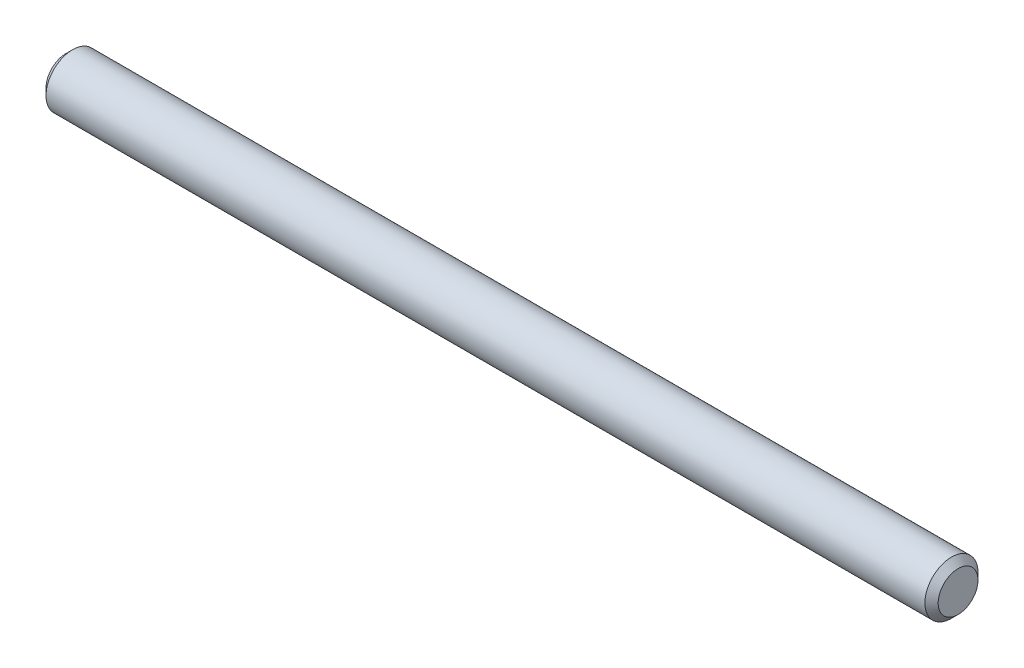
ISO-10303-21;
HEADER;
FILE_DESCRIPTION(('STEP AP214'),'2;1');
FILE_NAME('part.step','',(''),(''),'','','');
FILE_SCHEMA(('AUTOMOTIVE_DESIGN { 1 0 10303 214 1 1 1 1 }'));
ENDSEC;
DATA;
#1=APPLICATION_CONTEXT('core data for automotive mechanical design processes');
#2=APPLICATION_PROTOCOL_DEFINITION('international standard','automotive_design',2000,#1);
#3=PRODUCT_CONTEXT('',#1,'mechanical');
#4=PRODUCT('Part','Part','',(#3));
#5=PRODUCT_RELATED_PRODUCT_CATEGORY('part','',(#4));
#6=PRODUCT_DEFINITION_FORMATION('','',#4);
#7=PRODUCT_DEFINITION_CONTEXT('part definition',#1,'design');
#8=PRODUCT_DEFINITION('design','',#6,#7);
#9=PRODUCT_DEFINITION_SHAPE('','',#8);
#10=(LENGTH_UNIT() NAMED_UNIT(*) SI_UNIT(.MILLI.,.METRE.));
#11=(NAMED_UNIT(*) PLANE_ANGLE_UNIT() SI_UNIT($,.RADIAN.));
#12=(NAMED_UNIT(*) SI_UNIT($,.STERADIAN.) SOLID_ANGLE_UNIT());
#13=UNCERTAINTY_MEASURE_WITH_UNIT(LENGTH_MEASURE(1.E-05),#10,'distance_accuracy_value','');
#14=(GEOMETRIC_REPRESENTATION_CONTEXT(3) GLOBAL_UNCERTAINTY_ASSIGNED_CONTEXT((#13)) GLOBAL_UNIT_ASSIGNED_CONTEXT((#10,
#11,#12)) REPRESENTATION_CONTEXT('',''));
#15=CARTESIAN_POINT('',(0.,0.,0.));
#16=DIRECTION('',(0.,0.,1.));
#17=DIRECTION('',(1.,0.,0.));
#18=AXIS2_PLACEMENT_3D('',#15,#16,#17);
#19=CARTESIAN_POINT('',(-160.,0.,0.));
#20=DIRECTION('',(1.,0.,0.));
#21=DIRECTION('',(0.,0.,-1.));
#22=AXIS2_PLACEMENT_3D('',#19,#20,#21);
#23=CYLINDRICAL_SURFACE('',#22,4.76249999999998);
#24=CARTESIAN_POINT('',(-158.809375,0.,0.));
#25=DIRECTION('',(1.,0.,0.));
#26=DIRECTION('',(0.,0.,-1.));
#27=AXIS2_PLACEMENT_3D('',#24,#25,#26);
#28=CIRCLE('',#27,4.76249999999998);
#29=CARTESIAN_POINT('',(-158.809375,0.,-4.76249999999998));
#30=VERTEX_POINT('',#29);
#31=EDGE_CURVE('E52',#30,#30,#28,.T.);
#32=ORIENTED_EDGE('',*,*,#31,.T.);
#33=EDGE_LOOP('',(#32));
#34=FACE_BOUND('',#33,.T.);
#35=CARTESIAN_POINT('',(-1.190625,0.,0.));
#36=DIRECTION('',(1.,0.,0.));
#37=DIRECTION('',(0.,0.,-1.));
#38=AXIS2_PLACEMENT_3D('',#35,#36,#37);
#39=CIRCLE('',#38,4.76249999999998);
#40=CARTESIAN_POINT('',(-1.190625,0.,-4.76249999999998));
#41=VERTEX_POINT('',#40);
#42=EDGE_CURVE('E56',#41,#41,#39,.F.);
#43=ORIENTED_EDGE('',*,*,#42,.T.);
#44=EDGE_LOOP('',(#43));
#45=FACE_BOUND('',#44,.T.);
#46=ADVANCED_FACE('F41',(#34,#45),#23,.T.);
#47=CARTESIAN_POINT('',(-160.,0.,0.));
#48=DIRECTION('',(1.,0.,0.));
#49=DIRECTION('',(0.,0.,-1.));
#50=AXIS2_PLACEMENT_3D('',#47,#48,#49);
#51=PLANE('',#50);
#52=CARTESIAN_POINT('',(-160.,0.,0.));
#53=DIRECTION('',(1.,0.,0.));
#54=DIRECTION('',(0.,0.,-1.));
#55=AXIS2_PLACEMENT_3D('',#52,#53,#54);
#56=CIRCLE('',#55,3.57187499999996);
#57=CARTESIAN_POINT('',(-160.,0.,-3.57187499999996));
#58=VERTEX_POINT('',#57);
#59=EDGE_CURVE('E48',#58,#58,#56,.F.);
#60=ORIENTED_EDGE('',*,*,#59,.T.);
#61=EDGE_LOOP('',(#60));
#62=FACE_BOUND('',#61,.T.);
#63=ADVANCED_FACE('F72',(#62),#51,.F.);
#64=CARTESIAN_POINT('',(0.,0.,0.));
#65=DIRECTION('',(1.,0.,0.));
#66=DIRECTION('',(0.,0.,-1.));
#67=AXIS2_PLACEMENT_3D('',#64,#65,#66);
#68=PLANE('',#67);
#69=CARTESIAN_POINT('',(0.,0.,0.));
#70=DIRECTION('',(1.,0.,0.));
#71=DIRECTION('',(0.,0.,-1.));
#72=AXIS2_PLACEMENT_3D('',#69,#70,#71);
#73=CIRCLE('',#72,3.57187499999997);
#74=CARTESIAN_POINT('',(0.,0.,-3.57187499999997));
#75=VERTEX_POINT('',#74);
#76=EDGE_CURVE('E10',#75,#75,#73,.T.);
#77=ORIENTED_EDGE('',*,*,#76,.T.);
#78=EDGE_LOOP('',(#77));
#79=FACE_BOUND('',#78,.T.);
#80=ADVANCED_FACE('F69',(#79),#68,.T.);
#81=CARTESIAN_POINT('',(-158.809375,0.,0.));
#82=DIRECTION('',(1.,0.,0.));
#83=DIRECTION('',(0.,0.,-1.));
#84=AXIS2_PLACEMENT_3D('',#81,#82,#83);
#85=CONICAL_SURFACE('',#84,4.76249999999998,0.785398163397445);
#86=ORIENTED_EDGE('',*,*,#59,.F.);
#87=EDGE_LOOP('',(#86));
#88=FACE_BOUND('',#87,.T.);
#89=ORIENTED_EDGE('',*,*,#31,.F.);
#90=EDGE_LOOP('',(#89));
#91=FACE_BOUND('',#90,.T.);
#92=ADVANCED_FACE('F65',(#88,#91),#85,.T.);
#93=CARTESIAN_POINT('',(0.,0.,0.));
#94=DIRECTION('',(-1.,0.,0.));
#95=DIRECTION('',(0.,0.,1.));
#96=AXIS2_PLACEMENT_3D('',#93,#94,#95);
#97=CONICAL_SURFACE('',#96,3.57187499999997,0.785398163397451);
#98=ORIENTED_EDGE('',*,*,#42,.F.);
#99=EDGE_LOOP('',(#98));
#100=FACE_BOUND('',#99,.T.);
#101=ORIENTED_EDGE('',*,*,#76,.F.);
#102=EDGE_LOOP('',(#101));
#103=FACE_BOUND('',#102,.T.);
#104=ADVANCED_FACE('F43',(#100,#103),#97,.T.);
#105=CLOSED_SHELL('',(#46,#63,#80,#92,#104));
#106=MANIFOLD_SOLID_BREP('B2',#105);
#107=ADVANCED_BREP_SHAPE_REPRESENTATION('',(#18,#106),#14);
#108=SHAPE_DEFINITION_REPRESENTATION(#9,#107);
ENDSEC;
END-ISO-10303-21;
